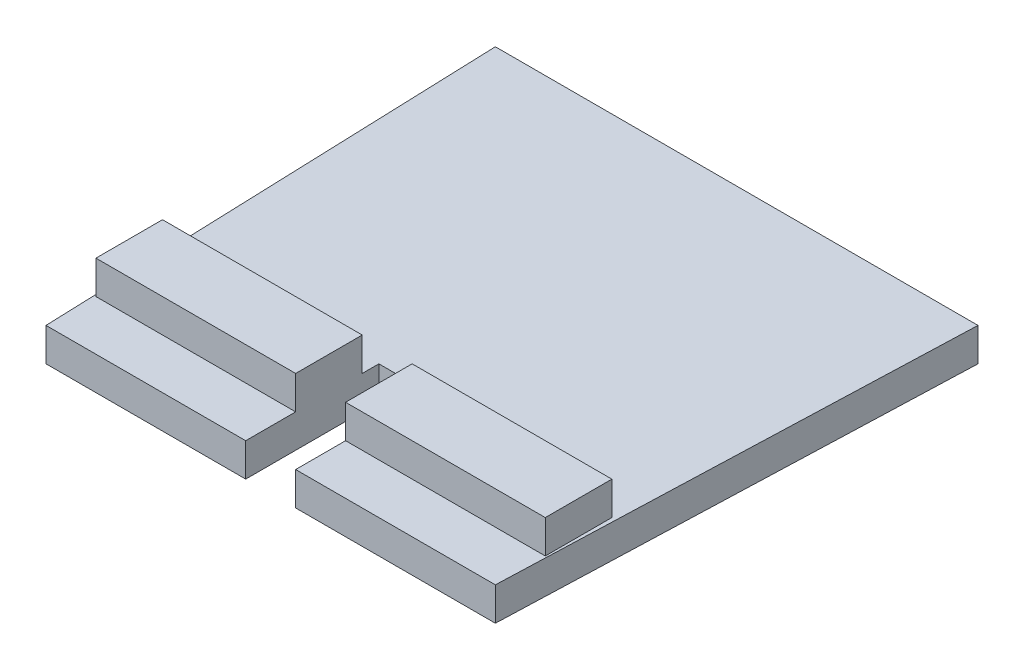
ISO-10303-21;
HEADER;
FILE_DESCRIPTION(('STEP AP214'),'2;1');
FILE_NAME('part.step','',(''),(''),'','','');
FILE_SCHEMA(('AUTOMOTIVE_DESIGN { 1 0 10303 214 1 1 1 1 }'));
ENDSEC;
DATA;
#1=APPLICATION_CONTEXT('core data for automotive mechanical design processes');
#2=APPLICATION_PROTOCOL_DEFINITION('international standard','automotive_design',2000,#1);
#3=PRODUCT_CONTEXT('',#1,'mechanical');
#4=PRODUCT('Part','Part','',(#3));
#5=PRODUCT_RELATED_PRODUCT_CATEGORY('part','',(#4));
#6=PRODUCT_DEFINITION_FORMATION('','',#4);
#7=PRODUCT_DEFINITION_CONTEXT('part definition',#1,'design');
#8=PRODUCT_DEFINITION('design','',#6,#7);
#9=PRODUCT_DEFINITION_SHAPE('','',#8);
#10=(LENGTH_UNIT() NAMED_UNIT(*) SI_UNIT(.MILLI.,.METRE.));
#11=(NAMED_UNIT(*) PLANE_ANGLE_UNIT() SI_UNIT($,.RADIAN.));
#12=(NAMED_UNIT(*) SI_UNIT($,.STERADIAN.) SOLID_ANGLE_UNIT());
#13=UNCERTAINTY_MEASURE_WITH_UNIT(LENGTH_MEASURE(1.E-05),#10,'distance_accuracy_value','');
#14=(GEOMETRIC_REPRESENTATION_CONTEXT(3) GLOBAL_UNCERTAINTY_ASSIGNED_CONTEXT((#13)) GLOBAL_UNIT_ASSIGNED_CONTEXT((#10,
#11,#12)) REPRESENTATION_CONTEXT('',''));
#15=CARTESIAN_POINT('',(0.,0.,0.));
#16=DIRECTION('',(0.,0.,1.));
#17=DIRECTION('',(1.,0.,0.));
#18=AXIS2_PLACEMENT_3D('',#15,#16,#17);
#19=CARTESIAN_POINT('',(0.,20.,0.));
#20=DIRECTION('',(0.,1.,0.));
#21=DIRECTION('',(0.,0.,1.));
#22=AXIS2_PLACEMENT_3D('',#19,#20,#21);
#23=PLANE('',#22);
#24=DIRECTION('',(1.,0.,0.));
#25=VECTOR('',#24,1.);
#26=CARTESIAN_POINT('',(0.,20.,-29.9999999999999));
#27=LINE('',#26,#25);
#28=CARTESIAN_POINT('',(150.,20.,-30.));
#29=VERTEX_POINT('',#28);
#30=CARTESIAN_POINT('',(270.,20.,-30.));
#31=VERTEX_POINT('',#30);
#32=EDGE_CURVE('E251',#29,#31,#27,.T.);
#33=ORIENTED_EDGE('',*,*,#32,.F.);
#34=DIRECTION('',(0.,0.,1.));
#35=VECTOR('',#34,1.);
#36=CARTESIAN_POINT('',(150.,20.,0.));
#37=LINE('',#36,#35);
#38=CARTESIAN_POINT('',(150.,20.,0.));
#39=VERTEX_POINT('',#38);
#40=EDGE_CURVE('E285',#29,#39,#37,.T.);
#41=ORIENTED_EDGE('',*,*,#40,.T.);
#42=DIRECTION('',(1.,0.,0.));
#43=VECTOR('',#42,1.);
#44=CARTESIAN_POINT('',(0.,20.,0.));
#45=LINE('',#44,#43);
#46=CARTESIAN_POINT('',(270.,20.,0.));
#47=VERTEX_POINT('',#46);
#48=EDGE_CURVE('E266',#39,#47,#45,.T.);
#49=ORIENTED_EDGE('',*,*,#48,.T.);
#50=DIRECTION('',(0.0356915305124125,0.,-0.999362854347549));
#51=VECTOR('',#50,1.);
#52=CARTESIAN_POINT('',(270.,20.,0.));
#53=LINE('',#52,#51);
#54=CARTESIAN_POINT('',(280.,20.,-280.));
#55=VERTEX_POINT('',#54);
#56=EDGE_CURVE('E210',#47,#55,#53,.T.);
#57=ORIENTED_EDGE('',*,*,#56,.T.);
#58=DIRECTION('',(-1.,0.,0.));
#59=VECTOR('',#58,1.);
#60=CARTESIAN_POINT('',(280.,20.,-280.));
#61=LINE('',#60,#59);
#62=CARTESIAN_POINT('',(-9.99999999999998,20.,-280.));
#63=VERTEX_POINT('',#62);
#64=EDGE_CURVE('E200',#55,#63,#61,.T.);
#65=ORIENTED_EDGE('',*,*,#64,.T.);
#66=DIRECTION('',(0.0356915305124124,0.,0.99936285434755));
#67=VECTOR('',#66,1.);
#68=CARTESIAN_POINT('',(-9.99999999999998,20.,-280.));
#69=LINE('',#68,#67);
#70=CARTESIAN_POINT('',(0.,20.,0.));
#71=VERTEX_POINT('',#70);
#72=EDGE_CURVE('E264',#63,#71,#69,.T.);
#73=ORIENTED_EDGE('',*,*,#72,.T.);
#74=CARTESIAN_POINT('',(120.,20.,0.));
#75=VERTEX_POINT('',#74);
#76=EDGE_CURVE('E267',#71,#75,#45,.T.);
#77=ORIENTED_EDGE('',*,*,#76,.T.);
#78=DIRECTION('',(0.,0.,1.));
#79=VECTOR('',#78,1.);
#80=CARTESIAN_POINT('',(120.,20.,0.));
#81=LINE('',#80,#79);
#82=CARTESIAN_POINT('',(120.,20.,-30.));
#83=VERTEX_POINT('',#82);
#84=EDGE_CURVE('E170',#83,#75,#81,.T.);
#85=ORIENTED_EDGE('',*,*,#84,.F.);
#86=CARTESIAN_POINT('',(0.,20.,-29.9999999999999));
#87=VERTEX_POINT('',#86);
#88=EDGE_CURVE('E252',#87,#83,#27,.T.);
#89=ORIENTED_EDGE('',*,*,#88,.F.);
#90=DIRECTION('',(0.,0.,1.));
#91=VECTOR('',#90,1.);
#92=CARTESIAN_POINT('',(0.,20.,0.));
#93=LINE('',#92,#91);
#94=CARTESIAN_POINT('',(0.,20.,-70.));
#95=VERTEX_POINT('',#94);
#96=EDGE_CURVE('E255',#95,#87,#93,.T.);
#97=ORIENTED_EDGE('',*,*,#96,.F.);
#98=DIRECTION('',(1.,0.,0.));
#99=VECTOR('',#98,1.);
#100=CARTESIAN_POINT('',(0.,20.,-70.));
#101=LINE('',#100,#99);
#102=CARTESIAN_POINT('',(120.,20.,-70.));
#103=VERTEX_POINT('',#102);
#104=EDGE_CURVE('E168',#95,#103,#101,.T.);
#105=ORIENTED_EDGE('',*,*,#104,.T.);
#106=CARTESIAN_POINT('',(120.,20.,-80.));
#107=VERTEX_POINT('',#106);
#108=EDGE_CURVE('E160',#107,#103,#81,.T.);
#109=ORIENTED_EDGE('',*,*,#108,.F.);
#110=DIRECTION('',(-1.,0.,0.));
#111=VECTOR('',#110,1.);
#112=CARTESIAN_POINT('',(0.,20.,-80.));
#113=LINE('',#112,#111);
#114=CARTESIAN_POINT('',(150.,20.,-80.));
#115=VERTEX_POINT('',#114);
#116=EDGE_CURVE('E149',#115,#107,#113,.T.);
#117=ORIENTED_EDGE('',*,*,#116,.F.);
#118=CARTESIAN_POINT('',(150.,20.,-70.));
#119=VERTEX_POINT('',#118);
#120=EDGE_CURVE('E289',#115,#119,#37,.T.);
#121=ORIENTED_EDGE('',*,*,#120,.T.);
#122=CARTESIAN_POINT('',(270.,20.,-70.));
#123=VERTEX_POINT('',#122);
#124=EDGE_CURVE('E56',#119,#123,#101,.T.);
#125=ORIENTED_EDGE('',*,*,#124,.T.);
#126=DIRECTION('',(0.,0.,1.));
#127=VECTOR('',#126,1.);
#128=CARTESIAN_POINT('',(270.,20.,0.));
#129=LINE('',#128,#127);
#130=EDGE_CURVE('E259',#123,#31,#129,.T.);
#131=ORIENTED_EDGE('',*,*,#130,.T.);
#132=EDGE_LOOP('',(#33,#41,#49,#57,#65,#73,#77,#85,#89,#97,#105,#109,#117,#121,#125,#131));
#133=FACE_BOUND('',#132,.T.);
#134=ADVANCED_FACE('F33',(#133),#23,.T.);
#135=CARTESIAN_POINT('',(0.,20.,0.));
#136=DIRECTION('',(0.,0.,-1.));
#137=DIRECTION('',(-1.,0.,0.));
#138=AXIS2_PLACEMENT_3D('',#135,#136,#137);
#139=PLANE('',#138);
#140=DIRECTION('',(0.,-1.,0.));
#141=VECTOR('',#140,1.);
#142=CARTESIAN_POINT('',(150.,40.,0.));
#143=LINE('',#142,#141);
#144=CARTESIAN_POINT('',(150.,0.,0.));
#145=VERTEX_POINT('',#144);
#146=EDGE_CURVE('E178',#39,#145,#143,.T.);
#147=ORIENTED_EDGE('',*,*,#146,.T.);
#148=DIRECTION('',(1.,0.,0.));
#149=VECTOR('',#148,1.);
#150=CARTESIAN_POINT('',(0.,0.,0.));
#151=LINE('',#150,#149);
#152=CARTESIAN_POINT('',(270.,0.,0.));
#153=VERTEX_POINT('',#152);
#154=EDGE_CURVE('E198',#145,#153,#151,.T.);
#155=ORIENTED_EDGE('',*,*,#154,.T.);
#156=DIRECTION('',(0.,-1.,0.));
#157=VECTOR('',#156,1.);
#158=CARTESIAN_POINT('',(270.,20.,0.));
#159=LINE('',#158,#157);
#160=EDGE_CURVE('E209',#47,#153,#159,.T.);
#161=ORIENTED_EDGE('',*,*,#160,.F.);
#162=ORIENTED_EDGE('',*,*,#48,.F.);
#163=EDGE_LOOP('',(#147,#155,#161,#162));
#164=FACE_BOUND('',#163,.T.);
#165=ADVANCED_FACE('F287',(#164),#139,.F.);
#166=CARTESIAN_POINT('',(0.,0.,0.));
#167=DIRECTION('',(0.,1.,0.));
#168=DIRECTION('',(0.,0.,1.));
#169=AXIS2_PLACEMENT_3D('',#166,#167,#168);
#170=PLANE('',#169);
#171=DIRECTION('',(0.,0.,1.));
#172=VECTOR('',#171,1.);
#173=CARTESIAN_POINT('',(150.,0.,0.));
#174=LINE('',#173,#172);
#175=CARTESIAN_POINT('',(150.,0.,-80.));
#176=VERTEX_POINT('',#175);
#177=EDGE_CURVE('E157',#176,#145,#174,.T.);
#178=ORIENTED_EDGE('',*,*,#177,.F.);
#179=DIRECTION('',(-1.,0.,0.));
#180=VECTOR('',#179,1.);
#181=CARTESIAN_POINT('',(0.,0.,-80.));
#182=LINE('',#181,#180);
#183=CARTESIAN_POINT('',(120.,0.,-80.));
#184=VERTEX_POINT('',#183);
#185=EDGE_CURVE('E11',#176,#184,#182,.T.);
#186=ORIENTED_EDGE('',*,*,#185,.T.);
#187=DIRECTION('',(0.,0.,1.));
#188=VECTOR('',#187,1.);
#189=CARTESIAN_POINT('',(120.,0.,0.));
#190=LINE('',#189,#188);
#191=CARTESIAN_POINT('',(120.,0.,0.));
#192=VERTEX_POINT('',#191);
#193=EDGE_CURVE('E162',#184,#192,#190,.T.);
#194=ORIENTED_EDGE('',*,*,#193,.T.);
#195=CARTESIAN_POINT('',(0.,0.,0.));
#196=VERTEX_POINT('',#195);
#197=EDGE_CURVE('E192',#196,#192,#151,.T.);
#198=ORIENTED_EDGE('',*,*,#197,.F.);
#199=DIRECTION('',(0.0356915305124124,0.,0.99936285434755));
#200=VECTOR('',#199,1.);
#201=CARTESIAN_POINT('',(-9.99999999999998,0.,-280.));
#202=LINE('',#201,#200);
#203=CARTESIAN_POINT('',(-9.99999999999998,0.,-280.));
#204=VERTEX_POINT('',#203);
#205=EDGE_CURVE('E202',#204,#196,#202,.T.);
#206=ORIENTED_EDGE('',*,*,#205,.F.);
#207=DIRECTION('',(-1.,0.,0.));
#208=VECTOR('',#207,1.);
#209=CARTESIAN_POINT('',(280.,0.,-280.));
#210=LINE('',#209,#208);
#211=CARTESIAN_POINT('',(280.,0.,-280.));
#212=VERTEX_POINT('',#211);
#213=EDGE_CURVE('E261',#212,#204,#210,.T.);
#214=ORIENTED_EDGE('',*,*,#213,.F.);
#215=DIRECTION('',(0.0356915305124125,0.,-0.999362854347549));
#216=VECTOR('',#215,1.);
#217=CARTESIAN_POINT('',(270.,0.,0.));
#218=LINE('',#217,#216);
#219=EDGE_CURVE('E197',#153,#212,#218,.T.);
#220=ORIENTED_EDGE('',*,*,#219,.F.);
#221=ORIENTED_EDGE('',*,*,#154,.F.);
#222=EDGE_LOOP('',(#178,#186,#194,#198,#206,#214,#220,#221));
#223=FACE_BOUND('',#222,.T.);
#224=ADVANCED_FACE('F191',(#223),#170,.F.);
#225=CARTESIAN_POINT('',(270.,40.,-70.));
#226=DIRECTION('',(0.,0.,1.));
#227=DIRECTION('',(1.,0.,0.));
#228=AXIS2_PLACEMENT_3D('',#225,#226,#227);
#229=PLANE('',#228);
#230=DIRECTION('',(0.,-1.,0.));
#231=VECTOR('',#230,1.);
#232=CARTESIAN_POINT('',(150.,40.,-70.));
#233=LINE('',#232,#231);
#234=CARTESIAN_POINT('',(150.,40.,-70.));
#235=VERTEX_POINT('',#234);
#236=EDGE_CURVE('E291',#235,#119,#233,.T.);
#237=ORIENTED_EDGE('',*,*,#236,.F.);
#238=DIRECTION('',(-1.,0.,0.));
#239=VECTOR('',#238,1.);
#240=CARTESIAN_POINT('',(270.,40.,-70.));
#241=LINE('',#240,#239);
#242=CARTESIAN_POINT('',(270.,40.,-70.));
#243=VERTEX_POINT('',#242);
#244=EDGE_CURVE('E226',#243,#235,#241,.T.);
#245=ORIENTED_EDGE('',*,*,#244,.F.);
#246=DIRECTION('',(0.,-1.,0.));
#247=VECTOR('',#246,1.);
#248=CARTESIAN_POINT('',(270.,40.,-70.));
#249=LINE('',#248,#247);
#250=EDGE_CURVE('E248',#243,#123,#249,.T.);
#251=ORIENTED_EDGE('',*,*,#250,.T.);
#252=ORIENTED_EDGE('',*,*,#124,.F.);
#253=EDGE_LOOP('',(#237,#245,#251,#252));
#254=FACE_BOUND('',#253,.T.);
#255=ADVANCED_FACE('F319',(#254),#229,.F.);
#256=CARTESIAN_POINT('',(270.,40.,-30.));
#257=DIRECTION('',(0.,0.,1.));
#258=DIRECTION('',(1.,0.,0.));
#259=AXIS2_PLACEMENT_3D('',#256,#257,#258);
#260=PLANE('',#259);
#261=DIRECTION('',(-1.,0.,0.));
#262=VECTOR('',#261,1.);
#263=CARTESIAN_POINT('',(270.,40.,-30.));
#264=LINE('',#263,#262);
#265=CARTESIAN_POINT('',(270.,40.,-30.));
#266=VERTEX_POINT('',#265);
#267=CARTESIAN_POINT('',(150.,40.,-29.9999999999999));
#268=VERTEX_POINT('',#267);
#269=EDGE_CURVE('E225',#266,#268,#264,.T.);
#270=ORIENTED_EDGE('',*,*,#269,.T.);
#271=DIRECTION('',(0.,-1.,0.));
#272=VECTOR('',#271,1.);
#273=CARTESIAN_POINT('',(150.,40.,-30.));
#274=LINE('',#273,#272);
#275=EDGE_CURVE('E171',#268,#29,#274,.T.);
#276=ORIENTED_EDGE('',*,*,#275,.T.);
#277=ORIENTED_EDGE('',*,*,#32,.T.);
#278=DIRECTION('',(0.,-1.,0.));
#279=VECTOR('',#278,1.);
#280=CARTESIAN_POINT('',(270.,40.,-30.));
#281=LINE('',#280,#279);
#282=EDGE_CURVE('E233',#266,#31,#281,.T.);
#283=ORIENTED_EDGE('',*,*,#282,.F.);
#284=EDGE_LOOP('',(#270,#276,#277,#283));
#285=FACE_BOUND('',#284,.T.);
#286=ADVANCED_FACE('F231',(#285),#260,.T.);
#287=CARTESIAN_POINT('',(0.,40.,0.));
#288=DIRECTION('',(0.,1.,0.));
#289=DIRECTION('',(0.,0.,1.));
#290=AXIS2_PLACEMENT_3D('',#287,#288,#289);
#291=PLANE('',#290);
#292=ORIENTED_EDGE('',*,*,#244,.T.);
#293=DIRECTION('',(0.,0.,1.));
#294=VECTOR('',#293,1.);
#295=CARTESIAN_POINT('',(150.,40.,0.));
#296=LINE('',#295,#294);
#297=EDGE_CURVE('E41',#235,#268,#296,.T.);
#298=ORIENTED_EDGE('',*,*,#297,.T.);
#299=ORIENTED_EDGE('',*,*,#269,.F.);
#300=DIRECTION('',(0.,0.,-1.));
#301=VECTOR('',#300,1.);
#302=CARTESIAN_POINT('',(270.,40.,-30.));
#303=LINE('',#302,#301);
#304=EDGE_CURVE('E156',#266,#243,#303,.T.);
#305=ORIENTED_EDGE('',*,*,#304,.T.);
#306=EDGE_LOOP('',(#292,#298,#299,#305));
#307=FACE_BOUND('',#306,.T.);
#308=ADVANCED_FACE('F223',(#307),#291,.T.);
#309=CARTESIAN_POINT('',(280.,20.,-280.));
#310=DIRECTION('',(0.,0.,1.));
#311=DIRECTION('',(1.,0.,0.));
#312=AXIS2_PLACEMENT_3D('',#309,#310,#311);
#313=PLANE('',#312);
#314=ORIENTED_EDGE('',*,*,#213,.T.);
#315=DIRECTION('',(0.,-1.,0.));
#316=VECTOR('',#315,1.);
#317=CARTESIAN_POINT('',(-9.99999999999998,20.,-280.));
#318=LINE('',#317,#316);
#319=EDGE_CURVE('E214',#63,#204,#318,.T.);
#320=ORIENTED_EDGE('',*,*,#319,.F.);
#321=ORIENTED_EDGE('',*,*,#64,.F.);
#322=DIRECTION('',(0.,-1.,0.));
#323=VECTOR('',#322,1.);
#324=CARTESIAN_POINT('',(280.,20.,-280.));
#325=LINE('',#324,#323);
#326=EDGE_CURVE('E206',#55,#212,#325,.T.);
#327=ORIENTED_EDGE('',*,*,#326,.T.);
#328=EDGE_LOOP('',(#314,#320,#321,#327));
#329=FACE_BOUND('',#328,.T.);
#330=ADVANCED_FACE('F35',(#329),#313,.F.);
#331=CARTESIAN_POINT('',(-9.99999999999998,20.,-280.));
#332=DIRECTION('',(0.99936285434755,0.,-0.0356915305124124));
#333=DIRECTION('',(-0.0356915305124124,0.,-0.99936285434755));
#334=AXIS2_PLACEMENT_3D('',#331,#332,#333);
#335=PLANE('',#334);
#336=ORIENTED_EDGE('',*,*,#205,.T.);
#337=DIRECTION('',(0.,-1.,0.));
#338=VECTOR('',#337,1.);
#339=CARTESIAN_POINT('',(0.,20.,0.));
#340=LINE('',#339,#338);
#341=EDGE_CURVE('E196',#71,#196,#340,.T.);
#342=ORIENTED_EDGE('',*,*,#341,.F.);
#343=ORIENTED_EDGE('',*,*,#72,.F.);
#344=ORIENTED_EDGE('',*,*,#319,.T.);
#345=EDGE_LOOP('',(#336,#342,#343,#344));
#346=FACE_BOUND('',#345,.T.);
#347=ADVANCED_FACE('F274',(#346),#335,.F.);
#348=ORIENTED_EDGE('',*,*,#197,.T.);
#349=DIRECTION('',(0.,-1.,0.));
#350=VECTOR('',#349,1.);
#351=CARTESIAN_POINT('',(120.,40.,0.));
#352=LINE('',#351,#350);
#353=EDGE_CURVE('E163',#75,#192,#352,.T.);
#354=ORIENTED_EDGE('',*,*,#353,.F.);
#355=ORIENTED_EDGE('',*,*,#76,.F.);
#356=ORIENTED_EDGE('',*,*,#341,.T.);
#357=EDGE_LOOP('',(#348,#354,#355,#356));
#358=FACE_BOUND('',#357,.T.);
#359=ADVANCED_FACE('F194',(#358),#139,.F.);
#360=CARTESIAN_POINT('',(270.,20.,0.));
#361=DIRECTION('',(-0.99936285434755,0.,-0.0356915305124125));
#362=DIRECTION('',(-0.0356915305124125,0.,0.99936285434755));
#363=AXIS2_PLACEMENT_3D('',#360,#361,#362);
#364=PLANE('',#363);
#365=ORIENTED_EDGE('',*,*,#219,.T.);
#366=ORIENTED_EDGE('',*,*,#326,.F.);
#367=ORIENTED_EDGE('',*,*,#56,.F.);
#368=ORIENTED_EDGE('',*,*,#160,.T.);
#369=EDGE_LOOP('',(#365,#366,#367,#368));
#370=FACE_BOUND('',#369,.T.);
#371=ADVANCED_FACE('F279',(#370),#364,.F.);
#372=CARTESIAN_POINT('',(270.,40.,-30.));
#373=DIRECTION('',(-1.,0.,0.));
#374=DIRECTION('',(0.,0.,1.));
#375=AXIS2_PLACEMENT_3D('',#372,#373,#374);
#376=PLANE('',#375);
#377=ORIENTED_EDGE('',*,*,#130,.F.);
#378=ORIENTED_EDGE('',*,*,#250,.F.);
#379=ORIENTED_EDGE('',*,*,#304,.F.);
#380=ORIENTED_EDGE('',*,*,#282,.T.);
#381=EDGE_LOOP('',(#377,#378,#379,#380));
#382=FACE_BOUND('',#381,.T.);
#383=ADVANCED_FACE('F328',(#382),#376,.F.);
#384=CARTESIAN_POINT('',(120.,40.,-70.));
#385=VERTEX_POINT('',#384);
#386=CARTESIAN_POINT('',(0.,40.,-70.));
#387=VERTEX_POINT('',#386);
#388=EDGE_CURVE('E295',#385,#387,#241,.T.);
#389=ORIENTED_EDGE('',*,*,#388,.F.);
#390=DIRECTION('',(0.,-1.,0.));
#391=VECTOR('',#390,1.);
#392=CARTESIAN_POINT('',(120.,40.,-70.));
#393=LINE('',#392,#391);
#394=EDGE_CURVE('E48',#385,#103,#393,.T.);
#395=ORIENTED_EDGE('',*,*,#394,.T.);
#396=ORIENTED_EDGE('',*,*,#104,.F.);
#397=DIRECTION('',(0.,-1.,0.));
#398=VECTOR('',#397,1.);
#399=CARTESIAN_POINT('',(0.,40.,-70.));
#400=LINE('',#399,#398);
#401=EDGE_CURVE('E245',#387,#95,#400,.T.);
#402=ORIENTED_EDGE('',*,*,#401,.F.);
#403=EDGE_LOOP('',(#389,#395,#396,#402));
#404=FACE_BOUND('',#403,.T.);
#405=ADVANCED_FACE('F304',(#404),#229,.F.);
#406=CARTESIAN_POINT('',(0.,40.,-29.9999999999999));
#407=DIRECTION('',(-1.,0.,0.));
#408=DIRECTION('',(0.,0.,1.));
#409=AXIS2_PLACEMENT_3D('',#406,#407,#408);
#410=PLANE('',#409);
#411=ORIENTED_EDGE('',*,*,#401,.T.);
#412=ORIENTED_EDGE('',*,*,#96,.T.);
#413=DIRECTION('',(0.,-1.,0.));
#414=VECTOR('',#413,1.);
#415=CARTESIAN_POINT('',(0.,40.,-29.9999999999999));
#416=LINE('',#415,#414);
#417=CARTESIAN_POINT('',(0.,40.,-29.9999999999999));
#418=VERTEX_POINT('',#417);
#419=EDGE_CURVE('E237',#418,#87,#416,.T.);
#420=ORIENTED_EDGE('',*,*,#419,.F.);
#421=DIRECTION('',(0.,0.,-1.));
#422=VECTOR('',#421,1.);
#423=CARTESIAN_POINT('',(0.,40.,-29.9999999999999));
#424=LINE('',#423,#422);
#425=EDGE_CURVE('E239',#418,#387,#424,.T.);
#426=ORIENTED_EDGE('',*,*,#425,.T.);
#427=EDGE_LOOP('',(#411,#412,#420,#426));
#428=FACE_BOUND('',#427,.T.);
#429=ADVANCED_FACE('F307',(#428),#410,.T.);
#430=DIRECTION('',(0.,-1.,0.));
#431=VECTOR('',#430,1.);
#432=CARTESIAN_POINT('',(120.,40.,-30.));
#433=LINE('',#432,#431);
#434=CARTESIAN_POINT('',(120.,40.,-29.9999999999999));
#435=VERTEX_POINT('',#434);
#436=EDGE_CURVE('E175',#435,#83,#433,.T.);
#437=ORIENTED_EDGE('',*,*,#436,.F.);
#438=EDGE_CURVE('E235',#435,#418,#264,.T.);
#439=ORIENTED_EDGE('',*,*,#438,.T.);
#440=ORIENTED_EDGE('',*,*,#419,.T.);
#441=ORIENTED_EDGE('',*,*,#88,.T.);
#442=EDGE_LOOP('',(#437,#439,#440,#441));
#443=FACE_BOUND('',#442,.T.);
#444=ADVANCED_FACE('F309',(#443),#260,.T.);
#445=DIRECTION('',(0.,0.,1.));
#446=VECTOR('',#445,1.);
#447=CARTESIAN_POINT('',(120.,40.,0.));
#448=LINE('',#447,#446);
#449=EDGE_CURVE('E217',#385,#435,#448,.T.);
#450=ORIENTED_EDGE('',*,*,#449,.F.);
#451=ORIENTED_EDGE('',*,*,#388,.T.);
#452=ORIENTED_EDGE('',*,*,#425,.F.);
#453=ORIENTED_EDGE('',*,*,#438,.F.);
#454=EDGE_LOOP('',(#450,#451,#452,#453));
#455=FACE_BOUND('',#454,.T.);
#456=ADVANCED_FACE('F301',(#455),#291,.T.);
#457=CARTESIAN_POINT('',(120.,40.,-80.));
#458=DIRECTION('',(0.,0.,-1.));
#459=DIRECTION('',(-1.,0.,0.));
#460=AXIS2_PLACEMENT_3D('',#457,#458,#459);
#461=PLANE('',#460);
#462=ORIENTED_EDGE('',*,*,#116,.T.);
#463=DIRECTION('',(0.,-1.,0.));
#464=VECTOR('',#463,1.);
#465=CARTESIAN_POINT('',(120.,40.,-80.));
#466=LINE('',#465,#464);
#467=EDGE_CURVE('E152',#107,#184,#466,.T.);
#468=ORIENTED_EDGE('',*,*,#467,.T.);
#469=ORIENTED_EDGE('',*,*,#185,.F.);
#470=DIRECTION('',(0.,-1.,0.));
#471=VECTOR('',#470,1.);
#472=CARTESIAN_POINT('',(150.,40.,-80.));
#473=LINE('',#472,#471);
#474=EDGE_CURVE('E154',#115,#176,#473,.T.);
#475=ORIENTED_EDGE('',*,*,#474,.F.);
#476=EDGE_LOOP('',(#462,#468,#469,#475));
#477=FACE_BOUND('',#476,.T.);
#478=ADVANCED_FACE('F151',(#477),#461,.F.);
#479=CARTESIAN_POINT('',(150.,40.,0.));
#480=DIRECTION('',(-1.,0.,0.));
#481=DIRECTION('',(0.,0.,1.));
#482=AXIS2_PLACEMENT_3D('',#479,#480,#481);
#483=PLANE('',#482);
#484=ORIENTED_EDGE('',*,*,#177,.T.);
#485=ORIENTED_EDGE('',*,*,#146,.F.);
#486=ORIENTED_EDGE('',*,*,#40,.F.);
#487=ORIENTED_EDGE('',*,*,#275,.F.);
#488=ORIENTED_EDGE('',*,*,#297,.F.);
#489=ORIENTED_EDGE('',*,*,#236,.T.);
#490=ORIENTED_EDGE('',*,*,#120,.F.);
#491=ORIENTED_EDGE('',*,*,#474,.T.);
#492=EDGE_LOOP('',(#484,#485,#486,#487,#488,#489,#490,#491));
#493=FACE_BOUND('',#492,.T.);
#494=ADVANCED_FACE('F288',(#493),#483,.T.);
#495=CARTESIAN_POINT('',(120.,40.,0.));
#496=DIRECTION('',(-1.,0.,0.));
#497=DIRECTION('',(0.,0.,1.));
#498=AXIS2_PLACEMENT_3D('',#495,#496,#497);
#499=PLANE('',#498);
#500=ORIENTED_EDGE('',*,*,#467,.F.);
#501=ORIENTED_EDGE('',*,*,#108,.T.);
#502=ORIENTED_EDGE('',*,*,#394,.F.);
#503=ORIENTED_EDGE('',*,*,#449,.T.);
#504=ORIENTED_EDGE('',*,*,#436,.T.);
#505=ORIENTED_EDGE('',*,*,#84,.T.);
#506=ORIENTED_EDGE('',*,*,#353,.T.);
#507=ORIENTED_EDGE('',*,*,#193,.F.);
#508=EDGE_LOOP('',(#500,#501,#502,#503,#504,#505,#506,#507));
#509=FACE_BOUND('',#508,.T.);
#510=ADVANCED_FACE('F159',(#509),#499,.F.);
#511=CLOSED_SHELL('',(#134,#165,#224,#255,#286,#308,#330,#347,#359,#371,#383,#405,#429,#444,
#456,#478,#494,#510));
#512=MANIFOLD_SOLID_BREP('B2',#511);
#513=ADVANCED_BREP_SHAPE_REPRESENTATION('',(#18,#512),#14);
#514=SHAPE_DEFINITION_REPRESENTATION(#9,#513);
ENDSEC;
END-ISO-10303-21;
